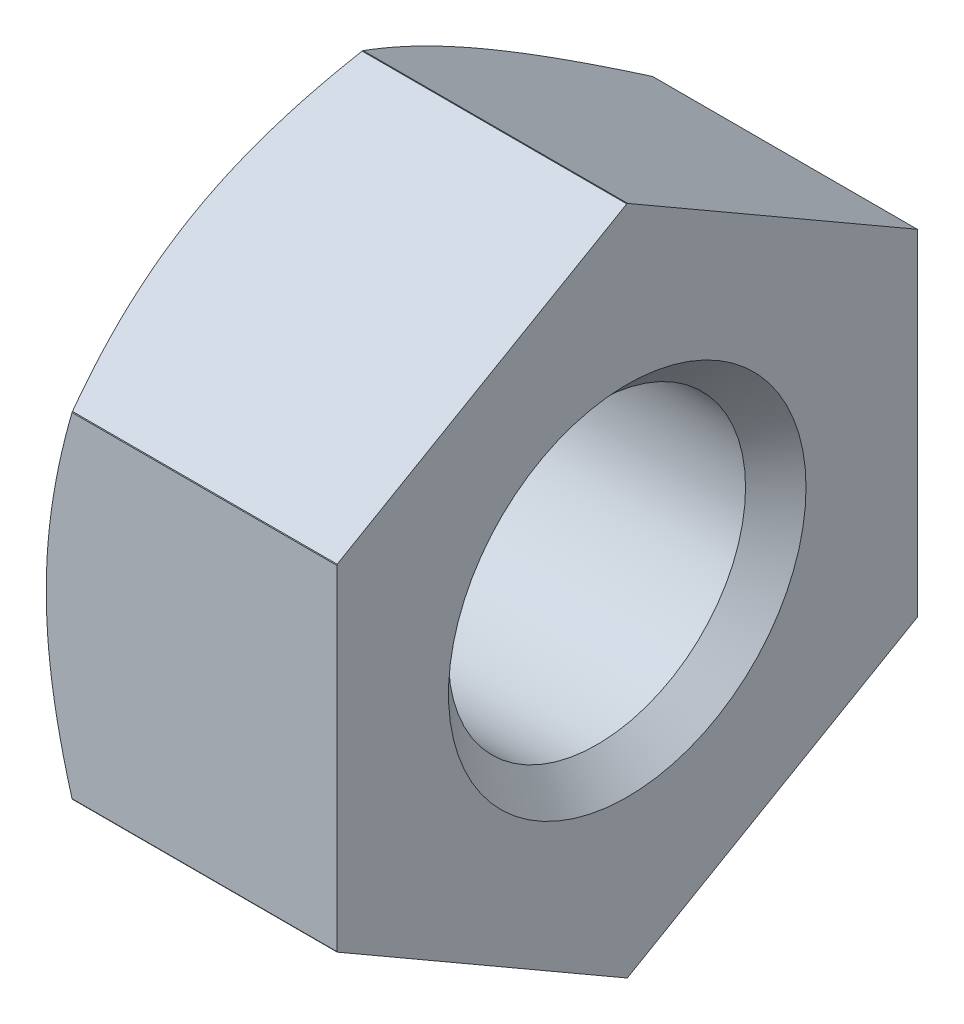
ISO-10303-21;
HEADER;
FILE_DESCRIPTION(('STEP AP214'),'2;1');
FILE_NAME('part.step','',(''),(''),'','','');
FILE_SCHEMA(('AUTOMOTIVE_DESIGN { 1 0 10303 214 1 1 1 1 }'));
ENDSEC;
DATA;
#1=APPLICATION_CONTEXT('core data for automotive mechanical design processes');
#2=APPLICATION_PROTOCOL_DEFINITION('international standard','automotive_design',2000,#1);
#3=PRODUCT_CONTEXT('',#1,'mechanical');
#4=PRODUCT('Part','Part','',(#3));
#5=PRODUCT_RELATED_PRODUCT_CATEGORY('part','',(#4));
#6=PRODUCT_DEFINITION_FORMATION('','',#4);
#7=PRODUCT_DEFINITION_CONTEXT('part definition',#1,'design');
#8=PRODUCT_DEFINITION('design','',#6,#7);
#9=PRODUCT_DEFINITION_SHAPE('','',#8);
#10=(LENGTH_UNIT() NAMED_UNIT(*) SI_UNIT(.MILLI.,.METRE.));
#11=(NAMED_UNIT(*) PLANE_ANGLE_UNIT() SI_UNIT($,.RADIAN.));
#12=(NAMED_UNIT(*) SI_UNIT($,.STERADIAN.) SOLID_ANGLE_UNIT());
#13=UNCERTAINTY_MEASURE_WITH_UNIT(LENGTH_MEASURE(1.E-05),#10,'distance_accuracy_value','');
#14=(GEOMETRIC_REPRESENTATION_CONTEXT(3) GLOBAL_UNCERTAINTY_ASSIGNED_CONTEXT((#13)) GLOBAL_UNIT_ASSIGNED_CONTEXT((#10,
#11,#12)) REPRESENTATION_CONTEXT('',''));
#15=CARTESIAN_POINT('',(0.,0.,0.));
#16=DIRECTION('',(0.,0.,1.));
#17=DIRECTION('',(1.,0.,0.));
#18=AXIS2_PLACEMENT_3D('',#15,#16,#17);
#19=CARTESIAN_POINT('',(-3.25,0.,0.));
#20=DIRECTION('',(1.,0.,0.));
#21=DIRECTION('',(0.,0.,-1.));
#22=AXIS2_PLACEMENT_3D('',#19,#20,#21);
#23=CONICAL_SURFACE('',#22,6.5,1.0471975511966);
#24=CARTESIAN_POINT('',(-2.67264973081037,0.,0.));
#25=DIRECTION('',(1.,0.,0.));
#26=DIRECTION('',(0.,0.,-1.));
#27=AXIS2_PLACEMENT_3D('',#24,#25,#26);
#28=CIRCLE('',#27,7.5);
#29=CARTESIAN_POINT('',(-2.67264973081037,-3.74165738677394,6.5));
#30=VERTEX_POINT('',#29);
#31=CARTESIAN_POINT('',(-2.67264973081037,-3.75833643121188,6.49037034920393));
#32=VERTEX_POINT('',#31);
#33=EDGE_CURVE('E256',#30,#32,#28,.T.);
#34=ORIENTED_EDGE('',*,*,#33,.F.);
#35=CARTESIAN_POINT('',(0.513966038198341,-11.2807032768234,6.5));
#36=CARTESIAN_POINT('',(0.378915058351472,-11.0106929496254,6.5));
#37=CARTESIAN_POINT('',(0.244796453527816,-10.7402113267163,6.5));
#38=CARTESIAN_POINT('',(-0.0211254341219864,-10.1980906881416,6.5));
#39=CARTESIAN_POINT('',(-0.152928561625526,-9.9264515963399,6.5));
#40=CARTESIAN_POINT('',(-0.414013701088781,-9.38128819389248,6.5));
#41=CARTESIAN_POINT('',(-0.543290093807788,-9.10776118640015,6.5));
#42=CARTESIAN_POINT('',(-0.798421465770674,-8.55911963721072,6.5));
#43=CARTESIAN_POINT('',(-0.924276512027707,-8.28400512673582,6.5));
#44=CARTESIAN_POINT('',(-1.17733855755452,-7.71947304531642,6.5));
#45=CARTESIAN_POINT('',(-1.30435202512197,-7.42996843345687,6.5));
#46=CARTESIAN_POINT('',(-1.55260283902653,-6.84846826653651,6.5));
#47=CARTESIAN_POINT('',(-1.67383992727068,-6.55647260085954,6.5));
#48=CARTESIAN_POINT('',(-1.90890006424744,-5.96970495823391,6.5));
#49=CARTESIAN_POINT('',(-2.02272767633869,-5.67493482057068,6.5));
#50=CARTESIAN_POINT('',(-2.24098183856443,-5.08195007559643,6.5));
#51=CARTESIAN_POINT('',(-2.34540941876381,-4.78373584974275,6.5));
#52=CARTESIAN_POINT('',(-2.56533110101402,-4.11290948228796,6.5));
#53=CARTESIAN_POINT('',(-2.67767795089335,-3.73924965009439,6.5));
#54=CARTESIAN_POINT('',(-2.87766589498791,-2.98519305091884,6.5));
#55=CARTESIAN_POINT('',(-2.96530921041283,-2.60479689290221,6.5));
#56=CARTESIAN_POINT('',(-3.07208493524288,-2.03294301933035,6.5));
#57=CARTESIAN_POINT('',(-3.10339628662217,-1.8437385474781,6.5));
#58=CARTESIAN_POINT('',(-3.15744028768143,-1.46411888005889,6.5));
#59=CARTESIAN_POINT('',(-3.18017417635376,-1.27370386339566,6.5));
#60=CARTESIAN_POINT('',(-3.21638325136801,-0.892043971298792,6.5));
#61=CARTESIAN_POINT('',(-3.22986110395232,-0.700799350823076,6.5));
#62=CARTESIAN_POINT('',(-3.24713153951669,-0.317869234826168,6.5));
#63=CARTESIAN_POINT('',(-3.25092416318924,-0.126183741160691,6.5));
#64=CARTESIAN_POINT('',(-3.24868841327486,0.258277391883954,6.5));
#65=CARTESIAN_POINT('',(-3.24260110728935,0.451052687384902,6.5));
#66=CARTESIAN_POINT('',(-3.22070207177715,0.836044700834553,6.5));
#67=CARTESIAN_POINT('',(-3.2048902990474,1.02826141629783,6.5));
#68=CARTESIAN_POINT('',(-3.16404541492919,1.41177826270723,6.5));
#69=CARTESIAN_POINT('',(-3.13900881361817,1.6030780189683,6.5));
#70=CARTESIAN_POINT('',(-3.0804515528631,1.98436380329014,6.5));
#71=CARTESIAN_POINT('',(-3.04693059649152,2.17434978513353,6.5));
#72=CARTESIAN_POINT('',(-2.93366417989931,2.74841894064958,6.5));
#73=CARTESIAN_POINT('',(-2.84195183295119,3.1301590250765,6.5));
#74=CARTESIAN_POINT('',(-2.63441436823466,3.88704186551285,6.5));
#75=CARTESIAN_POINT('',(-2.51857569354425,4.26218078315279,6.5));
#76=CARTESIAN_POINT('',(-2.29561068599052,4.92737410296624,6.5));
#77=CARTESIAN_POINT('',(-2.19185963050541,5.21857678477759,6.5));
#78=CARTESIAN_POINT('',(-1.9757189122552,5.79765005260513,6.5));
#79=CARTESIAN_POINT('',(-1.86333162694381,6.08552153073322,6.5));
#80=CARTESIAN_POINT('',(-1.63167301803463,6.65868937639089,6.5));
#81=CARTESIAN_POINT('',(-1.51239713888284,6.94398389214126,6.5));
#82=CARTESIAN_POINT('',(-1.26843552888664,7.51226296682233,6.5));
#83=CARTESIAN_POINT('',(-1.14374946301072,7.79524738140459,6.5));
#84=CARTESIAN_POINT('',(-0.895414243172232,8.34735190130622,6.5));
#85=CARTESIAN_POINT('',(-0.771943829251615,8.61655265299488,6.5));
#86=CARTESIAN_POINT('',(-0.521769659175034,9.15343973305855,6.5));
#87=CARTESIAN_POINT('',(-0.395065953193453,9.42112608485543,6.5));
#88=CARTESIAN_POINT('',(-0.13922754381552,9.95474907125058,6.5));
#89=CARTESIAN_POINT('',(-0.0100975429322016,10.2206879649649,6.5));
#90=CARTESIAN_POINT('',(0.25037852895172,10.7514697824317,6.5));
#91=CARTESIAN_POINT('',(0.381724538090111,11.0163127365224,6.5));
#92=CARTESIAN_POINT('',(0.513966038198342,11.2807032768234,6.5));
#93=B_SPLINE_CURVE_WITH_KNOTS('',3,(#35,#36,#37,#38,#39,#40,#41,#42,#43,#44,#45,#46,#47,#48,#49,
#50,#51,#52,#53,#54,#55,#56,#57,#58,#59,#60,#61,#62,#63,#64,#65,#66,#67,#68,#69,#70,#71,#72,#73,
#74,#75,#76,#77,#78,#79,#80,#81,#82,#83,#84,#85,#86,#87,#88,#89,#90,#91,#92),.UNSPECIFIED.,.F.,
.F.,(4,2,2,2,2,2,2,2,2,2,2,2,2,2,2,2,2,2,2,2,2,2,2,2,2,2,2,2,4),(0.,0.905708438315813,
1.8114774014896,2.71907268868311,3.62665018618176,4.57502434480836,5.52344083784104,
6.47126758154954,7.41899033469358,8.58895039360782,9.75880522238888,10.3339748090731,
10.9090612821583,11.4839820294639,12.0589003612356,12.637260620941,13.215623450156,
13.7942053097218,14.372807420754,15.5494364208804,16.7267283778033,17.6539675753379,
18.5809524229007,19.508557482872,20.4362200679765,21.324691140442,22.2131484339447,
23.1000323257576,23.9868915001017),.UNSPECIFIED.);
#94=CARTESIAN_POINT('',(-3.25,0.,6.5));
#95=VERTEX_POINT('',#94);
#96=EDGE_CURVE('E158',#30,#95,#93,.T.);
#97=ORIENTED_EDGE('',*,*,#96,.T.);
#98=CARTESIAN_POINT('',(-3.25,0.,0.));
#99=DIRECTION('',(1.,0.,0.));
#100=DIRECTION('',(0.,0.,-1.));
#101=AXIS2_PLACEMENT_3D('',#98,#99,#100);
#102=CIRCLE('',#101,6.5);
#103=CARTESIAN_POINT('',(-3.25,-5.62916512459885,3.25));
#104=VERTEX_POINT('',#103);
#105=EDGE_CURVE('E151',#95,#104,#102,.T.);
#106=ORIENTED_EDGE('',*,*,#105,.T.);
#107=CARTESIAN_POINT('',(-2.67253095147933,-7.5002,0.00927253307190731));
#108=CARTESIAN_POINT('',(-2.72001913064218,-7.41775563161322,0.152070367915739));
#109=CARTESIAN_POINT('',(-2.76534304192156,-7.33500392658634,0.295400525435251));
#110=CARTESIAN_POINT('',(-2.85106762804431,-7.16882906934167,0.583223821123516));
#111=CARTESIAN_POINT('',(-2.89146617970057,-7.08540564396672,0.727717432414365));
#112=CARTESIAN_POINT('',(-3.00447708058654,-6.83380429670984,1.16350374911606));
#113=CARTESIAN_POINT('',(-3.06870390244111,-6.66463481220595,1.45651389136703));
#114=CARTESIAN_POINT('',(-3.14392352273074,-6.41147683457757,1.89499637096077));
#115=CARTESIAN_POINT('',(-3.16533280571804,-6.32824110823067,2.03916487799851));
#116=CARTESIAN_POINT('',(-3.20118785584349,-6.16139618030002,2.32814877015956));
#117=CARTESIAN_POINT('',(-3.21563423716571,-6.0777870123137,2.47296409709042));
#118=CARTESIAN_POINT('',(-3.23719537297574,-5.91042585051035,2.76284213254758));
#119=CARTESIAN_POINT('',(-3.24431839664326,-5.82667412497835,2.90790437639057));
#120=CARTESIAN_POINT('',(-3.25108808832779,-5.65910091737203,3.198149685952));
#121=CARTESIAN_POINT('',(-3.25073499162458,-5.57527943757596,3.3433327477244));
#122=CARTESIAN_POINT('',(-3.23953051755739,-5.34633707063102,3.73987255927812));
#123=CARTESIAN_POINT('',(-3.22117796325503,-5.20129326626017,3.9910957977715));
#124=CARTESIAN_POINT('',(-3.16328853651205,-4.91216782421889,4.49187575314782));
#125=CARTESIAN_POINT('',(-3.12373238336519,-4.76808718328463,4.74143074363305));
#126=CARTESIAN_POINT('',(-3.02497429527427,-4.47839280420254,5.24319612687034));
#127=CARTESIAN_POINT('',(-2.96535910031848,-4.33281512611311,5.49534406176914));
#128=CARTESIAN_POINT('',(-2.83010357390194,-4.04381535659472,5.99590634595069));
#129=CARTESIAN_POINT('',(-2.75449446588391,-3.90038964000483,6.24432697419636));
#130=CARTESIAN_POINT('',(-2.67244973081037,-3.75798927286667,6.49097164509611));
#131=B_SPLINE_CURVE_WITH_KNOTS('',3,(#107,#108,#109,#110,#111,#112,#113,#114,#115,#116,#117,
#118,#119,#120,#121,#122,#123,#124,#125,#126,#127,#128,#129,#130),.UNSPECIFIED.,.F.,.F.,(4,2,2,
2,2,2,2,2,2,2,2,4),(0.,0.514731379845829,1.02968386753841,2.06170965059168,2.56511950040779,
3.06848493728598,3.57128137205489,4.07406198342241,4.9451617627619,5.81705499141625,
6.70813951240964,7.59750024581276),.UNSPECIFIED.);
#132=EDGE_CURVE('E124',#104,#32,#131,.T.);
#133=ORIENTED_EDGE('',*,*,#132,.T.);
#134=EDGE_LOOP('',(#34,#97,#106,#133));
#135=FACE_BOUND('',#134,.T.);
#136=ADVANCED_FACE('F16',(#135),#23,.T.);
#137=CARTESIAN_POINT('',(-3.25,5.62916512459885,3.25));
#138=VERTEX_POINT('',#137);
#139=EDGE_CURVE('E159',#138,#95,#102,.T.);
#140=ORIENTED_EDGE('',*,*,#139,.T.);
#141=CARTESIAN_POINT('',(-2.67264973081037,3.74165738677394,6.5));
#142=VERTEX_POINT('',#141);
#143=EDGE_CURVE('E211',#95,#142,#93,.T.);
#144=ORIENTED_EDGE('',*,*,#143,.T.);
#145=CARTESIAN_POINT('',(-2.67264973081037,3.75833643121188,6.49037034920393));
#146=VERTEX_POINT('',#145);
#147=EDGE_CURVE('E254',#146,#142,#28,.T.);
#148=ORIENTED_EDGE('',*,*,#147,.F.);
#149=CARTESIAN_POINT('',(-2.67244973081037,3.75798927286667,6.49097164509611));
#150=CARTESIAN_POINT('',(-2.71994125236903,3.84043477969422,6.34817183841502));
#151=CARTESIAN_POINT('',(-2.76526858993838,3.92318762873043,6.20483969941322));
#152=CARTESIAN_POINT('',(-2.85100018408263,4.08936479810202,5.91701239900366));
#153=CARTESIAN_POINT('',(-2.89140231752446,4.17278939160617,5.77251676445369));
#154=CARTESIAN_POINT('',(-3.00442421947421,4.42439437011456,5.33672415823989));
#155=CARTESIAN_POINT('',(-3.06865866260395,4.593566372692,5.04370965455759));
#156=CARTESIAN_POINT('',(-3.14388969628745,4.84672824498411,4.60522042920838));
#157=CARTESIAN_POINT('',(-3.16530272909364,4.92996524310988,4.46104971938504));
#158=CARTESIAN_POINT('',(-3.2011652349293,5.09681278854485,4.17206129357352));
#159=CARTESIAN_POINT('',(-3.2156153221822,5.18042330224811,4.02724363579253));
#160=CARTESIAN_POINT('',(-3.23718373135829,5.34778722475618,3.73736081865454));
#161=CARTESIAN_POINT('',(-3.24431032346991,5.43154036515696,3.59229612418693));
#162=CARTESIAN_POINT('',(-3.25108692556973,5.59911648023588,3.30204577873524));
#163=CARTESIAN_POINT('',(-3.25073717091767,5.68293945263258,3.1568601317027));
#164=CARTESIAN_POINT('',(-3.23954167546704,5.91188041236858,2.76032275750638));
#165=CARTESIAN_POINT('',(-3.22119531016325,6.05692139581857,2.50910440499124));
#166=CARTESIAN_POINT('',(-3.16331857355872,6.34604142166924,2.00833383073224));
#167=CARTESIAN_POINT('',(-3.12376892280207,6.49011946759793,1.75878333492852));
#168=CARTESIAN_POINT('',(-3.0250239021522,6.77980870923541,1.2570268500063));
#169=CARTESIAN_POINT('',(-2.96541527890383,6.92538384956388,1.00488331063842));
#170=CARTESIAN_POINT('',(-2.83017256872769,7.21437868725564,0.504329568631181));
#171=CARTESIAN_POINT('',(-2.75456970271474,7.35780200920418,0.255913088025998));
#172=CARTESIAN_POINT('',(-2.67253095147933,7.5002,0.00927253307190727));
#173=B_SPLINE_CURVE_WITH_KNOTS('',3,(#149,#150,#151,#152,#153,#154,#155,#156,#157,#158,#159,
#160,#161,#162,#163,#164,#165,#166,#167,#168,#169,#170,#171,#172),.UNSPECIFIED.,.F.,.F.,(4,2,2,
2,2,2,2,2,2,2,2,4),(0.,0.514740720413073,1.02970255394089,2.06174748770883,2.56516634115629,
3.06854077830261,3.57134614407122,4.07413568125798,4.94521743124215,5.81709257412305,
6.70815820086751,7.59750024848238),.UNSPECIFIED.);
#174=EDGE_CURVE('E236',#146,#138,#173,.T.);
#175=ORIENTED_EDGE('',*,*,#174,.T.);
#176=EDGE_LOOP('',(#140,#144,#148,#175));
#177=FACE_BOUND('',#176,.T.);
#178=ADVANCED_FACE('F338',(#177),#23,.T.);
#179=CARTESIAN_POINT('',(-3.25,0.,-6.5));
#180=VERTEX_POINT('',#179);
#181=CARTESIAN_POINT('',(-3.25,5.62916512459885,-3.25));
#182=VERTEX_POINT('',#181);
#183=EDGE_CURVE('E165',#180,#182,#102,.T.);
#184=ORIENTED_EDGE('',*,*,#183,.T.);
#185=CARTESIAN_POINT('',(-2.67253095147933,7.5002,-0.00927253307190731));
#186=CARTESIAN_POINT('',(-2.72001913064218,7.41775563161322,-0.152070367915739));
#187=CARTESIAN_POINT('',(-2.76534304192156,7.33500392658634,-0.295400525435251));
#188=CARTESIAN_POINT('',(-2.85106762804431,7.16882906934167,-0.583223821123516));
#189=CARTESIAN_POINT('',(-2.89146617970057,7.08540564396672,-0.727717432414365));
#190=CARTESIAN_POINT('',(-3.00447708058654,6.83380429670984,-1.16350374911606));
#191=CARTESIAN_POINT('',(-3.06870390244111,6.66463481220595,-1.45651389136703));
#192=CARTESIAN_POINT('',(-3.14392352273074,6.41147683457757,-1.89499637096077));
#193=CARTESIAN_POINT('',(-3.16533280571804,6.32824110823067,-2.03916487799851));
#194=CARTESIAN_POINT('',(-3.20118785584349,6.16139618030002,-2.32814877015956));
#195=CARTESIAN_POINT('',(-3.21563423716571,6.0777870123137,-2.47296409709042));
#196=CARTESIAN_POINT('',(-3.23719537297574,5.91042585051035,-2.76284213254758));
#197=CARTESIAN_POINT('',(-3.24431839664326,5.82667412497835,-2.90790437639057));
#198=CARTESIAN_POINT('',(-3.25108808832779,5.65910091737203,-3.198149685952));
#199=CARTESIAN_POINT('',(-3.25073499162458,5.57527943757596,-3.3433327477244));
#200=CARTESIAN_POINT('',(-3.23953051755739,5.34633707063102,-3.73987255927812));
#201=CARTESIAN_POINT('',(-3.22117796325503,5.20129326626017,-3.9910957977715));
#202=CARTESIAN_POINT('',(-3.16328853651205,4.91216782421889,-4.49187575314782));
#203=CARTESIAN_POINT('',(-3.12373238336519,4.76808718328463,-4.74143074363305));
#204=CARTESIAN_POINT('',(-3.02497429527427,4.47839280420254,-5.24319612687034));
#205=CARTESIAN_POINT('',(-2.96535910031848,4.33281512611311,-5.49534406176914));
#206=CARTESIAN_POINT('',(-2.83010357390194,4.04381535659472,-5.99590634595069));
#207=CARTESIAN_POINT('',(-2.75449446588391,3.90038964000483,-6.24432697419636));
#208=CARTESIAN_POINT('',(-2.67244973081037,3.75798927286667,-6.49097164509611));
#209=B_SPLINE_CURVE_WITH_KNOTS('',3,(#185,#186,#187,#188,#189,#190,#191,#192,#193,#194,#195,
#196,#197,#198,#199,#200,#201,#202,#203,#204,#205,#206,#207,#208),.UNSPECIFIED.,.F.,.F.,(4,2,2,
2,2,2,2,2,2,2,2,4),(0.,0.514731379845829,1.02968386753841,2.06170965059168,2.56511950040779,
3.06848493728598,3.57128137205489,4.07406198342241,4.9451617627619,5.81705499141625,
6.70813951240964,7.59750024581276),.UNSPECIFIED.);
#210=CARTESIAN_POINT('',(-2.67264973081037,3.75833643121188,-6.49037034920393));
#211=VERTEX_POINT('',#210);
#212=EDGE_CURVE('E286',#182,#211,#209,.T.);
#213=ORIENTED_EDGE('',*,*,#212,.T.);
#214=CARTESIAN_POINT('',(-2.67264973081037,3.74165738677394,-6.5));
#215=VERTEX_POINT('',#214);
#216=EDGE_CURVE('E193',#215,#211,#28,.T.);
#217=ORIENTED_EDGE('',*,*,#216,.F.);
#218=CARTESIAN_POINT('',(0.513966038198341,11.2807032768234,-6.5));
#219=CARTESIAN_POINT('',(0.378915058351472,11.0106929496254,-6.5));
#220=CARTESIAN_POINT('',(0.244796453527816,10.7402113267163,-6.5));
#221=CARTESIAN_POINT('',(-0.0211254341219864,10.1980906881416,-6.5));
#222=CARTESIAN_POINT('',(-0.152928561625526,9.9264515963399,-6.5));
#223=CARTESIAN_POINT('',(-0.414013701088781,9.38128819389248,-6.5));
#224=CARTESIAN_POINT('',(-0.543290093807788,9.10776118640015,-6.5));
#225=CARTESIAN_POINT('',(-0.798421465770674,8.55911963721072,-6.5));
#226=CARTESIAN_POINT('',(-0.924276512027707,8.28400512673582,-6.5));
#227=CARTESIAN_POINT('',(-1.17733855755452,7.71947304531642,-6.5));
#228=CARTESIAN_POINT('',(-1.30435202512197,7.42996843345687,-6.5));
#229=CARTESIAN_POINT('',(-1.55260283902653,6.84846826653651,-6.5));
#230=CARTESIAN_POINT('',(-1.67383992727068,6.55647260085954,-6.5));
#231=CARTESIAN_POINT('',(-1.90890006424744,5.96970495823391,-6.5));
#232=CARTESIAN_POINT('',(-2.02272767633869,5.67493482057068,-6.5));
#233=CARTESIAN_POINT('',(-2.24098183856443,5.08195007559643,-6.5));
#234=CARTESIAN_POINT('',(-2.34540941876381,4.78373584974275,-6.5));
#235=CARTESIAN_POINT('',(-2.56533110101402,4.11290948228796,-6.5));
#236=CARTESIAN_POINT('',(-2.67767795089335,3.73924965009439,-6.5));
#237=CARTESIAN_POINT('',(-2.87766589498791,2.98519305091884,-6.5));
#238=CARTESIAN_POINT('',(-2.96530921041283,2.60479689290221,-6.5));
#239=CARTESIAN_POINT('',(-3.07208493524288,2.03294301933035,-6.5));
#240=CARTESIAN_POINT('',(-3.10339628662217,1.8437385474781,-6.5));
#241=CARTESIAN_POINT('',(-3.15744028768143,1.46411888005889,-6.5));
#242=CARTESIAN_POINT('',(-3.18017417635376,1.27370386339566,-6.5));
#243=CARTESIAN_POINT('',(-3.21638325136801,0.892043971298792,-6.5));
#244=CARTESIAN_POINT('',(-3.22986110395232,0.700799350823076,-6.5));
#245=CARTESIAN_POINT('',(-3.24713153951669,0.317869234826168,-6.5));
#246=CARTESIAN_POINT('',(-3.25092416318924,0.126183741160691,-6.5));
#247=CARTESIAN_POINT('',(-3.24868841327486,-0.258277391883954,-6.5));
#248=CARTESIAN_POINT('',(-3.24260110728935,-0.451052687384902,-6.5));
#249=CARTESIAN_POINT('',(-3.22070207177715,-0.836044700834553,-6.5));
#250=CARTESIAN_POINT('',(-3.2048902990474,-1.02826141629783,-6.5));
#251=CARTESIAN_POINT('',(-3.16404541492919,-1.41177826270723,-6.5));
#252=CARTESIAN_POINT('',(-3.13900881361817,-1.6030780189683,-6.5));
#253=CARTESIAN_POINT('',(-3.0804515528631,-1.98436380329014,-6.5));
#254=CARTESIAN_POINT('',(-3.04693059649152,-2.17434978513353,-6.5));
#255=CARTESIAN_POINT('',(-2.93366417989931,-2.74841894064958,-6.5));
#256=CARTESIAN_POINT('',(-2.84195183295119,-3.1301590250765,-6.5));
#257=CARTESIAN_POINT('',(-2.63441436823466,-3.88704186551285,-6.5));
#258=CARTESIAN_POINT('',(-2.51857569354425,-4.26218078315279,-6.5));
#259=CARTESIAN_POINT('',(-2.29561068599052,-4.92737410296624,-6.5));
#260=CARTESIAN_POINT('',(-2.19185963050541,-5.21857678477759,-6.5));
#261=CARTESIAN_POINT('',(-1.9757189122552,-5.79765005260513,-6.5));
#262=CARTESIAN_POINT('',(-1.86333162694381,-6.08552153073322,-6.5));
#263=CARTESIAN_POINT('',(-1.63167301803463,-6.65868937639089,-6.5));
#264=CARTESIAN_POINT('',(-1.51239713888284,-6.94398389214126,-6.5));
#265=CARTESIAN_POINT('',(-1.26843552888664,-7.51226296682233,-6.5));
#266=CARTESIAN_POINT('',(-1.14374946301072,-7.79524738140459,-6.5));
#267=CARTESIAN_POINT('',(-0.895414243172232,-8.34735190130622,-6.5));
#268=CARTESIAN_POINT('',(-0.771943829251615,-8.61655265299488,-6.5));
#269=CARTESIAN_POINT('',(-0.521769659175034,-9.15343973305855,-6.5));
#270=CARTESIAN_POINT('',(-0.395065953193453,-9.42112608485543,-6.5));
#271=CARTESIAN_POINT('',(-0.13922754381552,-9.95474907125058,-6.5));
#272=CARTESIAN_POINT('',(-0.0100975429322016,-10.2206879649649,-6.5));
#273=CARTESIAN_POINT('',(0.25037852895172,-10.7514697824317,-6.5));
#274=CARTESIAN_POINT('',(0.381724538090111,-11.0163127365224,-6.5));
#275=CARTESIAN_POINT('',(0.513966038198342,-11.2807032768234,-6.5));
#276=B_SPLINE_CURVE_WITH_KNOTS('',3,(#218,#219,#220,#221,#222,#223,#224,#225,#226,#227,#228,
#229,#230,#231,#232,#233,#234,#235,#236,#237,#238,#239,#240,#241,#242,#243,#244,#245,#246,#247,
#248,#249,#250,#251,#252,#253,#254,#255,#256,#257,#258,#259,#260,#261,#262,#263,#264,#265,#266,
#267,#268,#269,#270,#271,#272,#273,#274,#275),.UNSPECIFIED.,.F.,.F.,(4,2,2,2,2,2,2,2,2,2,2,2,2,
2,2,2,2,2,2,2,2,2,2,2,2,2,2,2,4),(0.,0.905708438315813,1.8114774014896,2.71907268868311,
3.62665018618176,4.57502434480836,5.52344083784104,6.47126758154954,7.41899033469358,
8.58895039360782,9.75880522238888,10.3339748090731,10.9090612821583,11.4839820294639,
12.0589003612356,12.637260620941,13.215623450156,13.7942053097218,14.372807420754,
15.5494364208804,16.7267283778033,17.6539675753379,18.5809524229007,19.508557482872,
20.4362200679765,21.324691140442,22.2131484339447,23.1000323257576,23.9868915001017),.UNSPECIFIED.);
#277=EDGE_CURVE('E298',#215,#180,#276,.T.);
#278=ORIENTED_EDGE('',*,*,#277,.T.);
#279=EDGE_LOOP('',(#184,#213,#217,#278));
#280=FACE_BOUND('',#279,.T.);
#281=ADVANCED_FACE('F332',(#280),#23,.T.);
#282=CARTESIAN_POINT('',(-3.25,-5.62916512459885,-3.25));
#283=VERTEX_POINT('',#282);
#284=EDGE_CURVE('E155',#283,#180,#102,.T.);
#285=ORIENTED_EDGE('',*,*,#284,.T.);
#286=CARTESIAN_POINT('',(-2.67264973081037,-3.74165738677394,-6.5));
#287=VERTEX_POINT('',#286);
#288=EDGE_CURVE('E297',#180,#287,#276,.T.);
#289=ORIENTED_EDGE('',*,*,#288,.T.);
#290=CARTESIAN_POINT('',(-2.67264973081037,-3.75833643121188,-6.49037034920393));
#291=VERTEX_POINT('',#290);
#292=EDGE_CURVE('E258',#291,#287,#28,.T.);
#293=ORIENTED_EDGE('',*,*,#292,.F.);
#294=CARTESIAN_POINT('',(-2.67244973081037,-3.75798927286667,-6.49097164509611));
#295=CARTESIAN_POINT('',(-2.71994125236903,-3.84043477969422,-6.34817183841502));
#296=CARTESIAN_POINT('',(-2.76526858993838,-3.92318762873043,-6.20483969941322));
#297=CARTESIAN_POINT('',(-2.85100018408263,-4.08936479810202,-5.91701239900366));
#298=CARTESIAN_POINT('',(-2.89140231752446,-4.17278939160617,-5.77251676445369));
#299=CARTESIAN_POINT('',(-3.00442421947421,-4.42439437011456,-5.33672415823989));
#300=CARTESIAN_POINT('',(-3.06865866260395,-4.593566372692,-5.04370965455759));
#301=CARTESIAN_POINT('',(-3.14388969628745,-4.84672824498411,-4.60522042920838));
#302=CARTESIAN_POINT('',(-3.16530272909364,-4.92996524310988,-4.46104971938504));
#303=CARTESIAN_POINT('',(-3.2011652349293,-5.09681278854485,-4.17206129357352));
#304=CARTESIAN_POINT('',(-3.2156153221822,-5.18042330224811,-4.02724363579253));
#305=CARTESIAN_POINT('',(-3.23718373135829,-5.34778722475618,-3.73736081865454));
#306=CARTESIAN_POINT('',(-3.24431032346991,-5.43154036515696,-3.59229612418693));
#307=CARTESIAN_POINT('',(-3.25108692556973,-5.59911648023588,-3.30204577873524));
#308=CARTESIAN_POINT('',(-3.25073717091767,-5.68293945263258,-3.1568601317027));
#309=CARTESIAN_POINT('',(-3.23954167546704,-5.91188041236858,-2.76032275750638));
#310=CARTESIAN_POINT('',(-3.22119531016325,-6.05692139581857,-2.50910440499124));
#311=CARTESIAN_POINT('',(-3.16331857355872,-6.34604142166924,-2.00833383073224));
#312=CARTESIAN_POINT('',(-3.12376892280207,-6.49011946759793,-1.75878333492852));
#313=CARTESIAN_POINT('',(-3.0250239021522,-6.77980870923541,-1.2570268500063));
#314=CARTESIAN_POINT('',(-2.96541527890383,-6.92538384956388,-1.00488331063842));
#315=CARTESIAN_POINT('',(-2.83017256872769,-7.21437868725564,-0.504329568631181));
#316=CARTESIAN_POINT('',(-2.75456970271474,-7.35780200920418,-0.255913088025998));
#317=CARTESIAN_POINT('',(-2.67253095147933,-7.5002,-0.00927253307190727));
#318=B_SPLINE_CURVE_WITH_KNOTS('',3,(#294,#295,#296,#297,#298,#299,#300,#301,#302,#303,#304,
#305,#306,#307,#308,#309,#310,#311,#312,#313,#314,#315,#316,#317),.UNSPECIFIED.,.F.,.F.,(4,2,2,
2,2,2,2,2,2,2,2,4),(0.,0.514740720413073,1.02970255394089,2.06174748770883,2.56516634115629,
3.06854077830261,3.57134614407122,4.07413568125798,4.94521743124215,5.81709257412305,
6.70815820086751,7.59750024848238),.UNSPECIFIED.);
#319=EDGE_CURVE('E318',#291,#283,#318,.T.);
#320=ORIENTED_EDGE('',*,*,#319,.T.);
#321=EDGE_LOOP('',(#285,#289,#293,#320));
#322=FACE_BOUND('',#321,.T.);
#323=ADVANCED_FACE('F329',(#322),#23,.T.);
#324=EDGE_CURVE('E142',#104,#283,#102,.T.);
#325=ORIENTED_EDGE('',*,*,#324,.T.);
#326=CARTESIAN_POINT('',(-2.67264973081037,-7.49999381798582,-0.00962965079607046));
#327=VERTEX_POINT('',#326);
#328=EDGE_CURVE('E325',#283,#327,#318,.T.);
#329=ORIENTED_EDGE('',*,*,#328,.T.);
#330=CARTESIAN_POINT('',(-2.67264973081037,-7.49999381798582,0.00962965079606779));
#331=VERTEX_POINT('',#330);
#332=EDGE_CURVE('E144',#331,#327,#28,.T.);
#333=ORIENTED_EDGE('',*,*,#332,.F.);
#334=EDGE_CURVE('E127',#331,#104,#131,.T.);
#335=ORIENTED_EDGE('',*,*,#334,.T.);
#336=EDGE_LOOP('',(#325,#329,#333,#335));
#337=FACE_BOUND('',#336,.T.);
#338=ADVANCED_FACE('F140',(#337),#23,.T.);
#339=CARTESIAN_POINT('',(3.25,0.,0.));
#340=DIRECTION('',(1.,0.,0.));
#341=DIRECTION('',(0.,0.,-1.));
#342=AXIS2_PLACEMENT_3D('',#339,#340,#341);
#343=CYLINDRICAL_SURFACE('',#342,7.5);
#344=ORIENTED_EDGE('',*,*,#147,.T.);
#345=DIRECTION('',(1.,0.,0.));
#346=VECTOR('',#345,1.);
#347=CARTESIAN_POINT('',(3.25,3.74165738677394,6.5));
#348=LINE('',#347,#346);
#349=CARTESIAN_POINT('',(3.25,3.74165738677394,6.5));
#350=VERTEX_POINT('',#349);
#351=EDGE_CURVE('E191',#142,#350,#348,.T.);
#352=ORIENTED_EDGE('',*,*,#351,.T.);
#353=CARTESIAN_POINT('',(3.25,0.,0.));
#354=DIRECTION('',(1.,0.,0.));
#355=DIRECTION('',(0.,0.,-1.));
#356=AXIS2_PLACEMENT_3D('',#353,#354,#355);
#357=CIRCLE('',#356,7.5);
#358=CARTESIAN_POINT('',(3.25,3.75833643121188,6.49037034920393));
#359=VERTEX_POINT('',#358);
#360=EDGE_CURVE('E182',#359,#350,#357,.T.);
#361=ORIENTED_EDGE('',*,*,#360,.F.);
#362=DIRECTION('',(1.,0.,0.));
#363=VECTOR('',#362,1.);
#364=CARTESIAN_POINT('',(3.25,3.75833643121188,6.49037034920393));
#365=LINE('',#364,#363);
#366=EDGE_CURVE('E189',#359,#146,#365,.F.);
#367=ORIENTED_EDGE('',*,*,#366,.T.);
#368=EDGE_LOOP('',(#344,#352,#361,#367));
#369=FACE_BOUND('',#368,.T.);
#370=ADVANCED_FACE('F188',(#369),#343,.T.);
#371=ORIENTED_EDGE('',*,*,#216,.T.);
#372=DIRECTION('',(1.,0.,0.));
#373=VECTOR('',#372,1.);
#374=CARTESIAN_POINT('',(3.25,3.75833643121188,-6.49037034920393));
#375=LINE('',#374,#373);
#376=CARTESIAN_POINT('',(3.25,3.75833643121188,-6.49037034920393));
#377=VERTEX_POINT('',#376);
#378=EDGE_CURVE('E282',#211,#377,#375,.T.);
#379=ORIENTED_EDGE('',*,*,#378,.T.);
#380=CARTESIAN_POINT('',(3.25,3.74165738677394,-6.5));
#381=VERTEX_POINT('',#380);
#382=EDGE_CURVE('E194',#381,#377,#357,.T.);
#383=ORIENTED_EDGE('',*,*,#382,.F.);
#384=DIRECTION('',(1.,0.,0.));
#385=VECTOR('',#384,1.);
#386=CARTESIAN_POINT('',(3.25,3.74165738677394,-6.5));
#387=LINE('',#386,#385);
#388=EDGE_CURVE('E39',#381,#215,#387,.F.);
#389=ORIENTED_EDGE('',*,*,#388,.T.);
#390=EDGE_LOOP('',(#371,#379,#383,#389));
#391=FACE_BOUND('',#390,.T.);
#392=ADVANCED_FACE('F281',(#391),#343,.T.);
#393=ORIENTED_EDGE('',*,*,#292,.T.);
#394=DIRECTION('',(1.,0.,0.));
#395=VECTOR('',#394,1.);
#396=CARTESIAN_POINT('',(3.25,-3.74165738677394,-6.5));
#397=LINE('',#396,#395);
#398=CARTESIAN_POINT('',(3.25,-3.74165738677394,-6.5));
#399=VERTEX_POINT('',#398);
#400=EDGE_CURVE('E295',#287,#399,#397,.T.);
#401=ORIENTED_EDGE('',*,*,#400,.T.);
#402=CARTESIAN_POINT('',(3.25,-3.75833643121188,-6.49037034920393));
#403=VERTEX_POINT('',#402);
#404=EDGE_CURVE('E276',#403,#399,#357,.T.);
#405=ORIENTED_EDGE('',*,*,#404,.F.);
#406=DIRECTION('',(1.,0.,0.));
#407=VECTOR('',#406,1.);
#408=CARTESIAN_POINT('',(3.25,-3.75833643121188,-6.49037034920393));
#409=LINE('',#408,#407);
#410=EDGE_CURVE('E326',#403,#291,#409,.F.);
#411=ORIENTED_EDGE('',*,*,#410,.T.);
#412=EDGE_LOOP('',(#393,#401,#405,#411));
#413=FACE_BOUND('',#412,.T.);
#414=ADVANCED_FACE('F397',(#413),#343,.T.);
#415=ORIENTED_EDGE('',*,*,#332,.T.);
#416=DIRECTION('',(1.,0.,0.));
#417=VECTOR('',#416,1.);
#418=CARTESIAN_POINT('',(3.25,-7.49999381798582,-0.00962965079606779));
#419=LINE('',#418,#417);
#420=CARTESIAN_POINT('',(3.25,-7.49999381798582,-0.00962965079607104));
#421=VERTEX_POINT('',#420);
#422=EDGE_CURVE('E275',#327,#421,#419,.T.);
#423=ORIENTED_EDGE('',*,*,#422,.T.);
#424=CARTESIAN_POINT('',(3.25,-7.49999381798582,0.00962965079607213));
#425=VERTEX_POINT('',#424);
#426=EDGE_CURVE('E196',#425,#421,#357,.T.);
#427=ORIENTED_EDGE('',*,*,#426,.F.);
#428=DIRECTION('',(1.,0.,0.));
#429=VECTOR('',#428,1.);
#430=CARTESIAN_POINT('',(3.25,-7.49999381798582,0.00962965079606779));
#431=LINE('',#430,#429);
#432=EDGE_CURVE('E145',#425,#331,#431,.F.);
#433=ORIENTED_EDGE('',*,*,#432,.T.);
#434=EDGE_LOOP('',(#415,#423,#427,#433));
#435=FACE_BOUND('',#434,.T.);
#436=ADVANCED_FACE('F274',(#435),#343,.T.);
#437=CARTESIAN_POINT('',(3.25,-3.74165738677394,6.5));
#438=VERTEX_POINT('',#437);
#439=CARTESIAN_POINT('',(3.25,-3.75833643121188,6.49037034920393));
#440=VERTEX_POINT('',#439);
#441=EDGE_CURVE('E192',#438,#440,#357,.T.);
#442=ORIENTED_EDGE('',*,*,#441,.F.);
#443=DIRECTION('',(1.,0.,0.));
#444=VECTOR('',#443,1.);
#445=CARTESIAN_POINT('',(3.25,-3.74165738677394,6.5));
#446=LINE('',#445,#444);
#447=EDGE_CURVE('E218',#438,#30,#446,.F.);
#448=ORIENTED_EDGE('',*,*,#447,.T.);
#449=ORIENTED_EDGE('',*,*,#33,.T.);
#450=DIRECTION('',(1.,0.,0.));
#451=VECTOR('',#450,1.);
#452=CARTESIAN_POINT('',(3.25,-3.75833643121188,6.49037034920393));
#453=LINE('',#452,#451);
#454=EDGE_CURVE('E130',#32,#440,#453,.T.);
#455=ORIENTED_EDGE('',*,*,#454,.T.);
#456=EDGE_LOOP('',(#442,#448,#449,#455));
#457=FACE_BOUND('',#456,.T.);
#458=ADVANCED_FACE('F271',(#457),#343,.T.);
#459=CARTESIAN_POINT('',(-3.25,0.,0.));
#460=DIRECTION('',(1.,0.,0.));
#461=DIRECTION('',(0.,0.,-1.));
#462=AXIS2_PLACEMENT_3D('',#459,#460,#461);
#463=PLANE('',#462);
#464=EDGE_CURVE('E160',#182,#138,#102,.T.);
#465=ORIENTED_EDGE('',*,*,#464,.F.);
#466=ORIENTED_EDGE('',*,*,#183,.F.);
#467=ORIENTED_EDGE('',*,*,#284,.F.);
#468=ORIENTED_EDGE('',*,*,#324,.F.);
#469=ORIENTED_EDGE('',*,*,#105,.F.);
#470=ORIENTED_EDGE('',*,*,#139,.F.);
#471=EDGE_LOOP('',(#465,#466,#467,#468,#469,#470));
#472=FACE_BOUND('',#471,.T.);
#473=CARTESIAN_POINT('',(-3.25,0.,0.));
#474=DIRECTION('',(1.,0.,0.));
#475=DIRECTION('',(0.,0.,-1.));
#476=AXIS2_PLACEMENT_3D('',#473,#474,#475);
#477=CIRCLE('',#476,4.);
#478=CARTESIAN_POINT('',(-3.25,0.,-4.));
#479=VERTEX_POINT('',#478);
#480=EDGE_CURVE('E198',#479,#479,#477,.T.);
#481=ORIENTED_EDGE('',*,*,#480,.T.);
#482=EDGE_LOOP('',(#481));
#483=FACE_BOUND('',#482,.T.);
#484=ADVANCED_FACE('F18',(#472,#483),#463,.F.);
#485=ORIENTED_EDGE('',*,*,#464,.T.);
#486=CARTESIAN_POINT('',(-2.67264973081037,7.49999381798582,0.00962965079607046));
#487=VERTEX_POINT('',#486);
#488=EDGE_CURVE('E243',#138,#487,#173,.T.);
#489=ORIENTED_EDGE('',*,*,#488,.T.);
#490=CARTESIAN_POINT('',(-2.67264973081037,7.49999381798582,-0.00962965079606779));
#491=VERTEX_POINT('',#490);
#492=EDGE_CURVE('E166',#491,#487,#28,.T.);
#493=ORIENTED_EDGE('',*,*,#492,.F.);
#494=EDGE_CURVE('E287',#491,#182,#209,.T.);
#495=ORIENTED_EDGE('',*,*,#494,.T.);
#496=EDGE_LOOP('',(#485,#489,#493,#495));
#497=FACE_BOUND('',#496,.T.);
#498=ADVANCED_FACE('F220',(#497),#23,.T.);
#499=CARTESIAN_POINT('',(3.25,7.49999381798582,-0.00962965079607213));
#500=VERTEX_POINT('',#499);
#501=CARTESIAN_POINT('',(3.25,7.49999381798582,0.00962965079607104));
#502=VERTEX_POINT('',#501);
#503=EDGE_CURVE('E31',#500,#502,#357,.T.);
#504=ORIENTED_EDGE('',*,*,#503,.F.);
#505=DIRECTION('',(1.,0.,0.));
#506=VECTOR('',#505,1.);
#507=CARTESIAN_POINT('',(3.25,7.49999381798582,-0.00962965079606779));
#508=LINE('',#507,#506);
#509=EDGE_CURVE('E253',#500,#491,#508,.F.);
#510=ORIENTED_EDGE('',*,*,#509,.T.);
#511=ORIENTED_EDGE('',*,*,#492,.T.);
#512=DIRECTION('',(1.,0.,0.));
#513=VECTOR('',#512,1.);
#514=CARTESIAN_POINT('',(3.25,7.49999381798582,0.00962965079606779));
#515=LINE('',#514,#513);
#516=EDGE_CURVE('E245',#487,#502,#515,.T.);
#517=ORIENTED_EDGE('',*,*,#516,.T.);
#518=EDGE_LOOP('',(#504,#510,#511,#517));
#519=FACE_BOUND('',#518,.T.);
#520=ADVANCED_FACE('F252',(#519),#343,.T.);
#521=CARTESIAN_POINT('',(3.25,7.5,0.));
#522=DIRECTION('',(-1.,0.,0.));
#523=DIRECTION('',(0.,0.,1.));
#524=AXIS2_PLACEMENT_3D('',#521,#522,#523);
#525=PLANE('',#524);
#526=CARTESIAN_POINT('',(3.25,0.,0.));
#527=DIRECTION('',(1.,0.,0.));
#528=DIRECTION('',(0.,0.,-1.));
#529=AXIS2_PLACEMENT_3D('',#526,#527,#528);
#530=CIRCLE('',#529,4.);
#531=CARTESIAN_POINT('',(3.25,0.,-4.));
#532=VERTEX_POINT('',#531);
#533=EDGE_CURVE('E207',#532,#532,#530,.T.);
#534=ORIENTED_EDGE('',*,*,#533,.F.);
#535=EDGE_LOOP('',(#534));
#536=FACE_BOUND('',#535,.T.);
#537=ORIENTED_EDGE('',*,*,#360,.T.);
#538=DIRECTION('',(0.,-1.,0.));
#539=VECTOR('',#538,1.);
#540=CARTESIAN_POINT('',(3.25,7.5,6.5));
#541=LINE('',#540,#539);
#542=EDGE_CURVE('E10',#350,#438,#541,.T.);
#543=ORIENTED_EDGE('',*,*,#542,.T.);
#544=ORIENTED_EDGE('',*,*,#441,.T.);
#545=DIRECTION('',(0.,-0.5,-0.866025403784439));
#546=VECTOR('',#545,1.);
#547=CARTESIAN_POINT('',(3.25,-3.75416512459885,6.49759526419164));
#548=LINE('',#547,#546);
#549=EDGE_CURVE('E164',#440,#425,#548,.T.);
#550=ORIENTED_EDGE('',*,*,#549,.T.);
#551=ORIENTED_EDGE('',*,*,#426,.T.);
#552=DIRECTION('',(0.,0.5,-0.866025403784439));
#553=VECTOR('',#552,1.);
#554=CARTESIAN_POINT('',(3.25,-3.75416512459885,-6.49759526419164));
#555=LINE('',#554,#553);
#556=EDGE_CURVE('E170',#421,#403,#555,.T.);
#557=ORIENTED_EDGE('',*,*,#556,.T.);
#558=ORIENTED_EDGE('',*,*,#404,.T.);
#559=DIRECTION('',(0.,1.,0.));
#560=VECTOR('',#559,1.);
#561=CARTESIAN_POINT('',(3.25,7.5,-6.5));
#562=LINE('',#561,#560);
#563=EDGE_CURVE('E173',#399,#381,#562,.T.);
#564=ORIENTED_EDGE('',*,*,#563,.T.);
#565=ORIENTED_EDGE('',*,*,#382,.T.);
#566=DIRECTION('',(0.,0.5,0.866025403784439));
#567=VECTOR('',#566,1.);
#568=CARTESIAN_POINT('',(3.25,7.50416512459885,-0.00240473580835512));
#569=LINE('',#568,#567);
#570=EDGE_CURVE('E175',#377,#500,#569,.T.);
#571=ORIENTED_EDGE('',*,*,#570,.T.);
#572=ORIENTED_EDGE('',*,*,#503,.T.);
#573=DIRECTION('',(0.,-0.5,0.866025403784439));
#574=VECTOR('',#573,1.);
#575=CARTESIAN_POINT('',(3.25,7.50416512459885,0.00240473580835519));
#576=LINE('',#575,#574);
#577=EDGE_CURVE('E24',#502,#359,#576,.T.);
#578=ORIENTED_EDGE('',*,*,#577,.T.);
#579=EDGE_LOOP('',(#537,#543,#544,#550,#551,#557,#558,#564,#565,#571,#572,#578));
#580=FACE_BOUND('',#579,.T.);
#581=ADVANCED_FACE('F181',(#536,#580),#525,.F.);
#582=CARTESIAN_POINT('',(-3.25,0.,0.));
#583=DIRECTION('',(-1.,0.,0.));
#584=DIRECTION('',(0.,0.,1.));
#585=AXIS2_PLACEMENT_3D('',#582,#583,#584);
#586=CONICAL_SURFACE('',#585,4.,0.785398163397448);
#587=CARTESIAN_POINT('',(-2.5735,0.,0.));
#588=DIRECTION('',(1.,0.,0.));
#589=DIRECTION('',(0.,0.,-1.));
#590=AXIS2_PLACEMENT_3D('',#587,#588,#589);
#591=CIRCLE('',#590,3.3235);
#592=CARTESIAN_POINT('',(-2.5735,0.,-3.3235));
#593=VERTEX_POINT('',#592);
#594=EDGE_CURVE('E201',#593,#593,#591,.T.);
#595=ORIENTED_EDGE('',*,*,#594,.T.);
#596=EDGE_LOOP('',(#595));
#597=FACE_BOUND('',#596,.T.);
#598=ORIENTED_EDGE('',*,*,#480,.F.);
#599=EDGE_LOOP('',(#598));
#600=FACE_BOUND('',#599,.T.);
#601=ADVANCED_FACE('F436',(#597,#600),#586,.F.);
#602=CARTESIAN_POINT('',(3.25,0.,0.));
#603=DIRECTION('',(1.,0.,0.));
#604=DIRECTION('',(0.,0.,-1.));
#605=AXIS2_PLACEMENT_3D('',#602,#603,#604);
#606=CYLINDRICAL_SURFACE('',#605,3.3235);
#607=CARTESIAN_POINT('',(2.5735,0.,0.));
#608=DIRECTION('',(1.,0.,0.));
#609=DIRECTION('',(0.,0.,-1.));
#610=AXIS2_PLACEMENT_3D('',#607,#608,#609);
#611=CIRCLE('',#610,3.3235);
#612=CARTESIAN_POINT('',(2.5735,0.,-3.3235));
#613=VERTEX_POINT('',#612);
#614=EDGE_CURVE('E204',#613,#613,#611,.T.);
#615=ORIENTED_EDGE('',*,*,#614,.T.);
#616=EDGE_LOOP('',(#615));
#617=FACE_BOUND('',#616,.T.);
#618=ORIENTED_EDGE('',*,*,#594,.F.);
#619=EDGE_LOOP('',(#618));
#620=FACE_BOUND('',#619,.T.);
#621=ADVANCED_FACE('F445',(#617,#620),#606,.F.);
#622=CARTESIAN_POINT('',(2.5735,0.,0.));
#623=DIRECTION('',(1.,0.,0.));
#624=DIRECTION('',(0.,0.,-1.));
#625=AXIS2_PLACEMENT_3D('',#622,#623,#624);
#626=CONICAL_SURFACE('',#625,3.3235,0.785398163397448);
#627=ORIENTED_EDGE('',*,*,#533,.T.);
#628=EDGE_LOOP('',(#627));
#629=FACE_BOUND('',#628,.T.);
#630=ORIENTED_EDGE('',*,*,#614,.F.);
#631=EDGE_LOOP('',(#630));
#632=FACE_BOUND('',#631,.T.);
#633=ADVANCED_FACE('F454',(#629,#632),#626,.F.);
#634=CARTESIAN_POINT('',(3.25,-3.75277674973257,6.5));
#635=DIRECTION('',(0.,0.866025403784439,-0.5));
#636=DIRECTION('',(0.,0.5,0.866025403784439));
#637=AXIS2_PLACEMENT_3D('',#634,#635,#636);
#638=PLANE('',#637);
#639=ORIENTED_EDGE('',*,*,#132,.F.);
#640=ORIENTED_EDGE('',*,*,#334,.F.);
#641=ORIENTED_EDGE('',*,*,#432,.F.);
#642=ORIENTED_EDGE('',*,*,#549,.F.);
#643=ORIENTED_EDGE('',*,*,#454,.F.);
#644=EDGE_LOOP('',(#639,#640,#641,#642,#643));
#645=FACE_BOUND('',#644,.T.);
#646=ADVANCED_FACE('F126',(#645),#638,.F.);
#647=CARTESIAN_POINT('',(3.25,-7.50555349946513,0.));
#648=DIRECTION('',(0.,0.866025403784439,0.5));
#649=DIRECTION('',(0.,-0.5,0.866025403784439));
#650=AXIS2_PLACEMENT_3D('',#647,#648,#649);
#651=PLANE('',#650);
#652=ORIENTED_EDGE('',*,*,#328,.F.);
#653=ORIENTED_EDGE('',*,*,#319,.F.);
#654=ORIENTED_EDGE('',*,*,#410,.F.);
#655=ORIENTED_EDGE('',*,*,#556,.F.);
#656=ORIENTED_EDGE('',*,*,#422,.F.);
#657=EDGE_LOOP('',(#652,#653,#654,#655,#656));
#658=FACE_BOUND('',#657,.T.);
#659=ADVANCED_FACE('F310',(#658),#651,.F.);
#660=CARTESIAN_POINT('',(3.25,-3.75277674973257,-6.5));
#661=DIRECTION('',(0.,0.,1.));
#662=DIRECTION('',(1.,0.,0.));
#663=AXIS2_PLACEMENT_3D('',#660,#661,#662);
#664=PLANE('',#663);
#665=ORIENTED_EDGE('',*,*,#288,.F.);
#666=ORIENTED_EDGE('',*,*,#277,.F.);
#667=ORIENTED_EDGE('',*,*,#388,.F.);
#668=ORIENTED_EDGE('',*,*,#563,.F.);
#669=ORIENTED_EDGE('',*,*,#400,.F.);
#670=EDGE_LOOP('',(#665,#666,#667,#668,#669));
#671=FACE_BOUND('',#670,.T.);
#672=ADVANCED_FACE('F306',(#671),#664,.F.);
#673=CARTESIAN_POINT('',(3.25,3.75277674973257,-6.5));
#674=DIRECTION('',(0.,-0.866025403784439,0.5));
#675=DIRECTION('',(0.,-0.5,-0.866025403784439));
#676=AXIS2_PLACEMENT_3D('',#673,#674,#675);
#677=PLANE('',#676);
#678=ORIENTED_EDGE('',*,*,#212,.F.);
#679=ORIENTED_EDGE('',*,*,#494,.F.);
#680=ORIENTED_EDGE('',*,*,#509,.F.);
#681=ORIENTED_EDGE('',*,*,#570,.F.);
#682=ORIENTED_EDGE('',*,*,#378,.F.);
#683=EDGE_LOOP('',(#678,#679,#680,#681,#682));
#684=FACE_BOUND('',#683,.T.);
#685=ADVANCED_FACE('F232',(#684),#677,.F.);
#686=CARTESIAN_POINT('',(3.25,7.50555349946513,0.));
#687=DIRECTION('',(0.,-0.866025403784439,-0.5));
#688=DIRECTION('',(0.,0.5,-0.866025403784439));
#689=AXIS2_PLACEMENT_3D('',#686,#687,#688);
#690=PLANE('',#689);
#691=ORIENTED_EDGE('',*,*,#488,.F.);
#692=ORIENTED_EDGE('',*,*,#174,.F.);
#693=ORIENTED_EDGE('',*,*,#366,.F.);
#694=ORIENTED_EDGE('',*,*,#577,.F.);
#695=ORIENTED_EDGE('',*,*,#516,.F.);
#696=EDGE_LOOP('',(#691,#692,#693,#694,#695));
#697=FACE_BOUND('',#696,.T.);
#698=ADVANCED_FACE('F227',(#697),#690,.F.);
#699=CARTESIAN_POINT('',(3.25,3.75277674973257,6.5));
#700=DIRECTION('',(0.,0.,-1.));
#701=DIRECTION('',(-1.,0.,0.));
#702=AXIS2_PLACEMENT_3D('',#699,#700,#701);
#703=PLANE('',#702);
#704=ORIENTED_EDGE('',*,*,#143,.F.);
#705=ORIENTED_EDGE('',*,*,#96,.F.);
#706=ORIENTED_EDGE('',*,*,#447,.F.);
#707=ORIENTED_EDGE('',*,*,#542,.F.);
#708=ORIENTED_EDGE('',*,*,#351,.F.);
#709=EDGE_LOOP('',(#704,#705,#706,#707,#708));
#710=FACE_BOUND('',#709,.T.);
#711=ADVANCED_FACE('F223',(#710),#703,.F.);
#712=CLOSED_SHELL('',(#136,#178,#281,#323,#338,#370,#392,#414,#436,#458,#484,#498,#520,#581,
#601,#621,#633,#646,#659,#672,#685,#698,#711));
#713=MANIFOLD_SOLID_BREP('B1',#712);
#714=ADVANCED_BREP_SHAPE_REPRESENTATION('',(#18,#713),#14);
#715=SHAPE_DEFINITION_REPRESENTATION(#9,#714);
ENDSEC;
END-ISO-10303-21;
